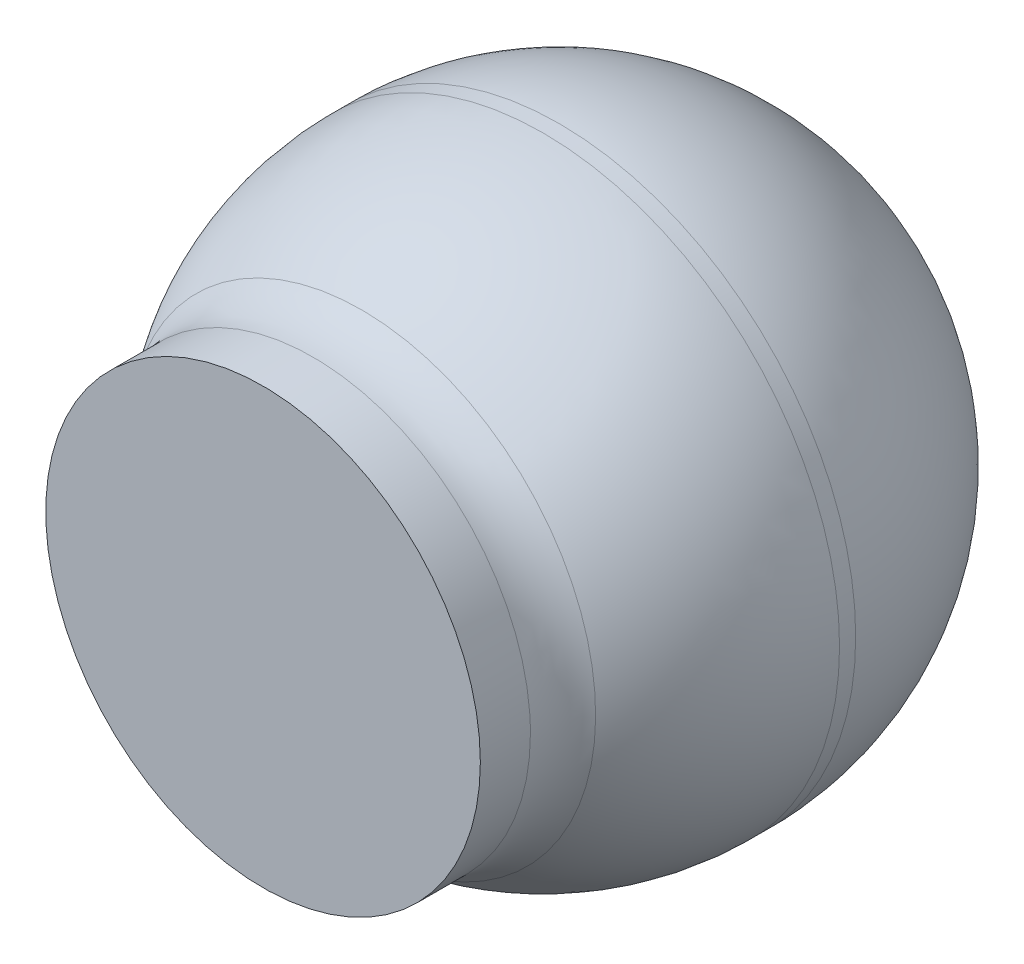
ISO-10303-21;
HEADER;
FILE_DESCRIPTION(('STEP AP214'),'2;1');
FILE_NAME('part.step','',(''),(''),'','','');
FILE_SCHEMA(('AUTOMOTIVE_DESIGN { 1 0 10303 214 1 1 1 1 }'));
ENDSEC;
DATA;
#1=APPLICATION_CONTEXT('core data for automotive mechanical design processes');
#2=APPLICATION_PROTOCOL_DEFINITION('international standard','automotive_design',2000,#1);
#3=PRODUCT_CONTEXT('',#1,'mechanical');
#4=PRODUCT('Part','Part','',(#3));
#5=PRODUCT_RELATED_PRODUCT_CATEGORY('part','',(#4));
#6=PRODUCT_DEFINITION_FORMATION('','',#4);
#7=PRODUCT_DEFINITION_CONTEXT('part definition',#1,'design');
#8=PRODUCT_DEFINITION('design','',#6,#7);
#9=PRODUCT_DEFINITION_SHAPE('','',#8);
#10=(LENGTH_UNIT() NAMED_UNIT(*) SI_UNIT(.MILLI.,.METRE.));
#11=(NAMED_UNIT(*) PLANE_ANGLE_UNIT() SI_UNIT($,.RADIAN.));
#12=(NAMED_UNIT(*) SI_UNIT($,.STERADIAN.) SOLID_ANGLE_UNIT());
#13=UNCERTAINTY_MEASURE_WITH_UNIT(LENGTH_MEASURE(1.E-05),#10,'distance_accuracy_value','');
#14=(GEOMETRIC_REPRESENTATION_CONTEXT(3) GLOBAL_UNCERTAINTY_ASSIGNED_CONTEXT((#13)) GLOBAL_UNIT_ASSIGNED_CONTEXT((#10,
#11,#12)) REPRESENTATION_CONTEXT('',''));
#15=CARTESIAN_POINT('',(0.,0.,0.));
#16=DIRECTION('',(0.,0.,1.));
#17=DIRECTION('',(1.,0.,0.));
#18=AXIS2_PLACEMENT_3D('',#15,#16,#17);
#19=CARTESIAN_POINT('',(-8.182919922269,-11.67134929145,10.006534503384));
#20=DIRECTION('',(0.,0.,-1.));
#21=DIRECTION('',(-1.,0.,0.));
#22=AXIS2_PLACEMENT_3D('',#19,#20,#21);
#23=PLANE('',#22);
#24=CARTESIAN_POINT('',(-8.182919922269,-11.67134929145,10.006534503384));
#25=DIRECTION('',(0.,0.,1.));
#26=DIRECTION('',(1.,0.,0.));
#27=AXIS2_PLACEMENT_3D('',#24,#25,#26);
#28=CIRCLE('',#27,0.275);
#29=CARTESIAN_POINT('',(-7.907919922269,-11.67134929145,10.006534503384));
#30=VERTEX_POINT('',#29);
#31=EDGE_CURVE('E20',#30,#30,#28,.F.);
#32=ORIENTED_EDGE('',*,*,#31,.F.);
#33=EDGE_LOOP('',(#32));
#34=FACE_BOUND('',#33,.T.);
#35=ADVANCED_FACE('F17',(#34),#23,.F.);
#36=CARTESIAN_POINT('',(-8.182919922269,-11.67134929145,9.906534503384));
#37=DIRECTION('',(0.,0.,1.));
#38=DIRECTION('',(1.,0.,0.));
#39=AXIS2_PLACEMENT_3D('',#36,#37,#38);
#40=CYLINDRICAL_SURFACE('',#39,0.275);
#41=CARTESIAN_POINT('',(-8.182919922269,-11.67134929145,9.943180457728));
#42=DIRECTION('',(0.,0.,-1.));
#43=DIRECTION('',(0.996700902337582,0.0811622527992467,0.));
#44=AXIS2_PLACEMENT_3D('',#41,#42,#43);
#45=CIRCLE('',#44,0.275000000000001);
#46=CARTESIAN_POINT('',(-7.90882717412616,-11.6490296719302,9.943180457728));
#47=VERTEX_POINT('',#46);
#48=EDGE_CURVE('E66',#47,#47,#45,.F.);
#49=ORIENTED_EDGE('',*,*,#48,.T.);
#50=EDGE_LOOP('',(#49));
#51=FACE_BOUND('',#50,.T.);
#52=ORIENTED_EDGE('',*,*,#31,.T.);
#53=EDGE_LOOP('',(#52));
#54=FACE_BOUND('',#53,.T.);
#55=ADVANCED_FACE('F62',(#51,#54),#40,.T.);
#56=CARTESIAN_POINT('',(-8.182919922269,-11.67134929145,9.943180457728));
#57=DIRECTION('',(0.,0.,-1.));
#58=DIRECTION('',(0.996700902337583,0.0811622527992448,0.));
#59=AXIS2_PLACEMENT_3D('',#56,#57,#58);
#60=TOROIDAL_SURFACE('',#59,0.375,0.1);
#61=ORIENTED_EDGE('',*,*,#48,.F.);
#62=EDGE_LOOP('',(#61));
#63=FACE_BOUND('',#62,.T.);
#64=CARTESIAN_POINT('',(-8.182919922269,-11.67134929145,9.881744931236));
#65=DIRECTION('',(0.,0.,-1.));
#66=DIRECTION('',(-0.996700902338691,-0.0811622527856359,0.));
#67=AXIS2_PLACEMENT_3D('',#64,#65,#66);
#68=CIRCLE('',#67,0.296097046412338);
#69=CARTESIAN_POINT('',(-8.478040115608,-11.69538119478,9.881744931236));
#70=VERTEX_POINT('',#69);
#71=EDGE_CURVE('E39',#70,#70,#68,.T.);
#72=ORIENTED_EDGE('',*,*,#71,.F.);
#73=EDGE_LOOP('',(#72));
#74=FACE_BOUND('',#73,.T.);
#75=ADVANCED_FACE('F57',(#63,#74),#60,.F.);
#76=CARTESIAN_POINT('',(-8.556682760645,-11.70178513625,9.651976062157));
#77=CARTESIAN_POINT('',(-8.556682760645,-11.70178513625,9.701461392103));
#78=CARTESIAN_POINT('',(-8.548526217348,-11.70112094157,9.750947004335));
#79=CARTESIAN_POINT('',(-8.532207085349,-11.69979205995,9.798626332798));
#80=CARTESIAN_POINT('',(-8.508341390838,-11.69784865493,9.842699544317));
#81=CARTESIAN_POINT('',(-8.478040115608,-11.69538119478,9.881744931236));
#82=(BOUNDED_CURVE() B_SPLINE_CURVE(5,(#76,#77,#78,#79,#80,#81),.UNSPECIFIED.,.F.,
.F.) B_SPLINE_CURVE_WITH_KNOTS((6,6),(0.,0.661568582165),
.UNSPECIFIED.) CURVE() GEOMETRIC_REPRESENTATION_ITEM() RATIONAL_B_SPLINE_CURVE((1.,1.,1.,1.,1.,1.)) REPRESENTATION_ITEM(''));
#83=CARTESIAN_POINT('',(-8.182919922269,-11.67134929145,9.651976062157));
#84=DIRECTION('',(0.,0.,-1.));
#85=AXIS1_PLACEMENT('',#83,#84);
#86=SURFACE_OF_REVOLUTION('',#82,#85);
#87=CARTESIAN_POINT('',(-8.182919922269,-11.67134929145,9.651976062157));
#88=DIRECTION('',(0.,0.,1.));
#89=DIRECTION('',(1.,0.,0.));
#90=AXIS2_PLACEMENT_3D('',#87,#88,#89);
#91=CIRCLE('',#90,0.375);
#92=CARTESIAN_POINT('',(-7.807919922269,-11.67134929145,9.651976062157));
#93=VERTEX_POINT('',#92);
#94=EDGE_CURVE('E36',#93,#93,#91,.F.);
#95=ORIENTED_EDGE('',*,*,#94,.F.);
#96=EDGE_LOOP('',(#95));
#97=FACE_BOUND('',#96,.T.);
#98=ORIENTED_EDGE('',*,*,#71,.T.);
#99=EDGE_LOOP('',(#98));
#100=FACE_BOUND('',#99,.T.);
#101=ADVANCED_FACE('F53',(#97,#100),#86,.F.);
#102=CARTESIAN_POINT('',(-8.182919922269,-11.67134929145,9.256534503384));
#103=DIRECTION('',(0.,0.,1.));
#104=DIRECTION('',(1.,0.,0.));
#105=AXIS2_PLACEMENT_3D('',#102,#103,#104);
#106=CYLINDRICAL_SURFACE('',#105,0.375);
#107=CARTESIAN_POINT('',(-8.182919922269,-11.67134929145,9.631534503384));
#108=DIRECTION('',(0.,0.,-1.));
#109=DIRECTION('',(0.0811622527992357,-0.996700902337583,0.));
#110=AXIS2_PLACEMENT_3D('',#107,#108,#109);
#111=CIRCLE('',#110,0.375);
#112=CARTESIAN_POINT('',(-8.15248407746929,-12.0451121298266,9.631534503384));
#113=VERTEX_POINT('',#112);
#114=CARTESIAN_POINT('',(-8.21335576706871,-11.2975864530734,9.631534503384));
#115=VERTEX_POINT('',#114);
#116=EDGE_CURVE('E11',#113,#115,#111,.T.);
#117=ORIENTED_EDGE('',*,*,#116,.F.);
#118=CARTESIAN_POINT('',(-8.182919922269,-11.67134929145,9.631534503384));
#119=DIRECTION('',(0.,0.,1.));
#120=DIRECTION('',(0.0811622527992365,-0.996700902337583,0.));
#121=AXIS2_PLACEMENT_3D('',#118,#119,#120);
#122=CIRCLE('',#121,0.375);
#123=EDGE_CURVE('E25',#115,#113,#122,.F.);
#124=ORIENTED_EDGE('',*,*,#123,.F.);
#125=EDGE_LOOP('',(#117,#124));
#126=FACE_BOUND('',#125,.T.);
#127=ORIENTED_EDGE('',*,*,#94,.T.);
#128=EDGE_LOOP('',(#127));
#129=FACE_BOUND('',#128,.T.);
#130=ADVANCED_FACE('F34',(#126,#129),#106,.T.);
#131=CARTESIAN_POINT('',(-8.182919922269,-11.67134929145,9.631534503384));
#132=DIRECTION('',(0.0811622527992361,-0.996700902337583,0.));
#133=DIRECTION('',(-0.996700902337583,-0.0811622527992361,0.));
#134=AXIS2_PLACEMENT_3D('',#131,#132,#133);
#135=SPHERICAL_SURFACE('',#134,0.375);
#136=ORIENTED_EDGE('',*,*,#123,.T.);
#137=ORIENTED_EDGE('',*,*,#116,.T.);
#138=EDGE_LOOP('',(#136,#137));
#139=FACE_BOUND('',#138,.T.);
#140=ADVANCED_FACE('F32',(#139),#135,.T.);
#141=CLOSED_SHELL('',(#35,#55,#75,#101,#130,#140));
#142=MANIFOLD_SOLID_BREP('B1',#141);
#143=ADVANCED_BREP_SHAPE_REPRESENTATION('',(#18,#142),#14);
#144=SHAPE_DEFINITION_REPRESENTATION(#9,#143);
ENDSEC;
END-ISO-10303-21;
